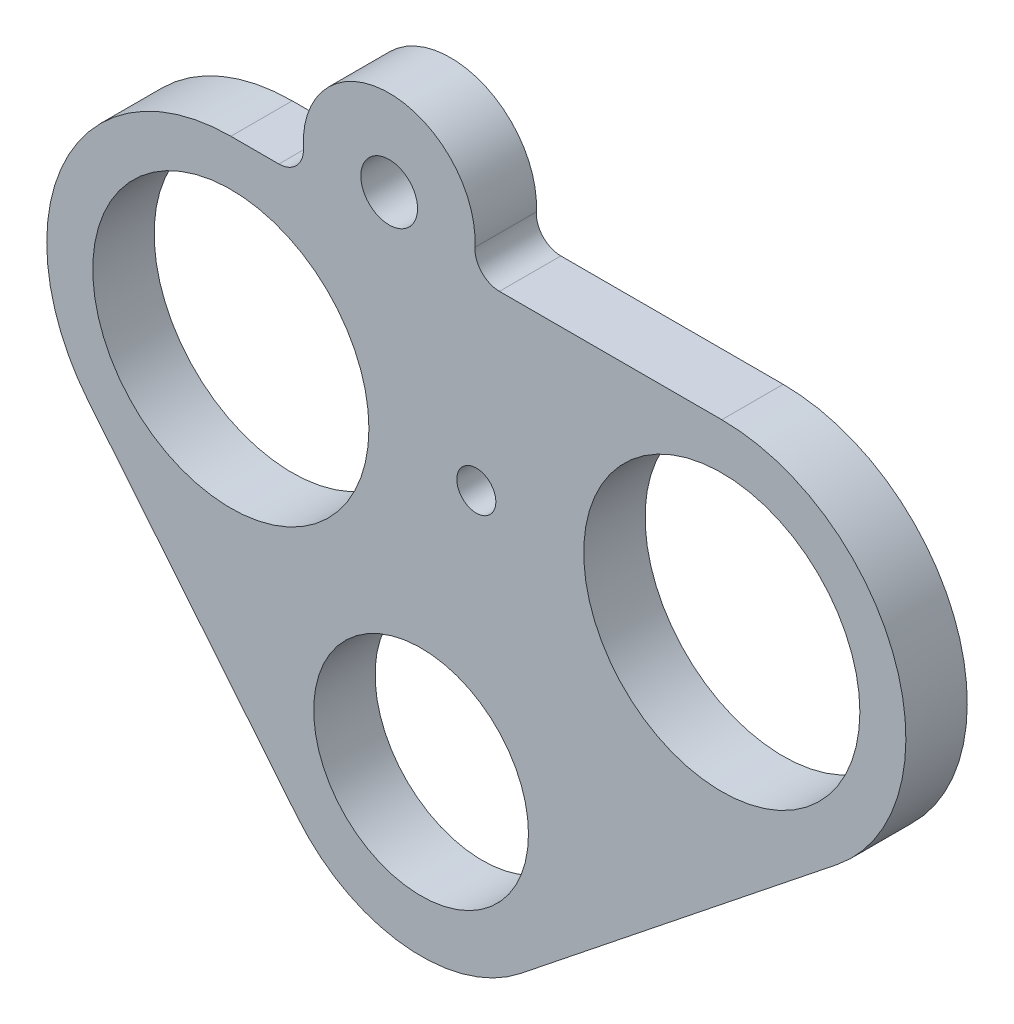
ISO-10303-21;
HEADER;
FILE_DESCRIPTION(('STEP AP214'),'2;1');
FILE_NAME('part.step','',(''),(''),'','','');
FILE_SCHEMA(('AUTOMOTIVE_DESIGN { 1 0 10303 214 1 1 1 1 }'));
ENDSEC;
DATA;
#1=APPLICATION_CONTEXT('core data for automotive mechanical design processes');
#2=APPLICATION_PROTOCOL_DEFINITION('international standard','automotive_design',2000,#1);
#3=PRODUCT_CONTEXT('',#1,'mechanical');
#4=PRODUCT('Part','Part','',(#3));
#5=PRODUCT_RELATED_PRODUCT_CATEGORY('part','',(#4));
#6=PRODUCT_DEFINITION_FORMATION('','',#4);
#7=PRODUCT_DEFINITION_CONTEXT('part definition',#1,'design');
#8=PRODUCT_DEFINITION('design','',#6,#7);
#9=PRODUCT_DEFINITION_SHAPE('','',#8);
#10=(LENGTH_UNIT() NAMED_UNIT(*) SI_UNIT(.MILLI.,.METRE.));
#11=(NAMED_UNIT(*) PLANE_ANGLE_UNIT() SI_UNIT($,.RADIAN.));
#12=(NAMED_UNIT(*) SI_UNIT($,.STERADIAN.) SOLID_ANGLE_UNIT());
#13=UNCERTAINTY_MEASURE_WITH_UNIT(LENGTH_MEASURE(1.E-05),#10,'distance_accuracy_value','');
#14=(GEOMETRIC_REPRESENTATION_CONTEXT(3) GLOBAL_UNCERTAINTY_ASSIGNED_CONTEXT((#13)) GLOBAL_UNIT_ASSIGNED_CONTEXT((#10,
#11,#12)) REPRESENTATION_CONTEXT('',''));
#15=CARTESIAN_POINT('',(0.,0.,0.));
#16=DIRECTION('',(0.,0.,1.));
#17=DIRECTION('',(1.,0.,0.));
#18=AXIS2_PLACEMENT_3D('',#15,#16,#17);
#19=CARTESIAN_POINT('',(-3.30200000000001,50.3017675311814,6.35));
#20=DIRECTION('',(0.,0.,-1.));
#21=DIRECTION('',(-1.,0.,0.));
#22=AXIS2_PLACEMENT_3D('',#19,#20,#21);
#23=CYLINDRICAL_SURFACE('',#22,8.89);
#24=CARTESIAN_POINT('',(-3.30200000000001,50.3017675311814,0.));
#25=DIRECTION('',(0.,0.,1.));
#26=DIRECTION('',(1.,0.,0.));
#27=AXIS2_PLACEMENT_3D('',#24,#25,#26);
#28=CIRCLE('',#27,8.89);
#29=CARTESIAN_POINT('',(5.57427026207697,49.8078786422925,0.));
#30=VERTEX_POINT('',#29);
#31=CARTESIAN_POINT('',(-12.178270262077,49.8078786422925,0.));
#32=VERTEX_POINT('',#31);
#33=EDGE_CURVE('E160',#30,#32,#28,.T.);
#34=ORIENTED_EDGE('',*,*,#33,.T.);
#35=DIRECTION('',(0.,0.,-1.));
#36=VECTOR('',#35,1.);
#37=CARTESIAN_POINT('',(-12.178270262077,49.8078786422925,6.35));
#38=LINE('',#37,#36);
#39=CARTESIAN_POINT('',(-12.178270262077,49.8078786422925,6.35));
#40=VERTEX_POINT('',#39);
#41=EDGE_CURVE('E190',#32,#40,#38,.F.);
#42=ORIENTED_EDGE('',*,*,#41,.T.);
#43=CARTESIAN_POINT('',(-3.30200000000001,50.3017675311814,6.35));
#44=DIRECTION('',(0.,0.,1.));
#45=DIRECTION('',(1.,0.,0.));
#46=AXIS2_PLACEMENT_3D('',#43,#44,#45);
#47=CIRCLE('',#46,8.89);
#48=CARTESIAN_POINT('',(5.57427026207697,49.8078786422925,6.35));
#49=VERTEX_POINT('',#48);
#50=EDGE_CURVE('E136',#49,#40,#47,.T.);
#51=ORIENTED_EDGE('',*,*,#50,.F.);
#52=DIRECTION('',(0.,0.,-1.));
#53=VECTOR('',#52,1.);
#54=CARTESIAN_POINT('',(5.57427026207697,49.8078786422925,6.35));
#55=LINE('',#54,#53);
#56=EDGE_CURVE('E187',#49,#30,#55,.T.);
#57=ORIENTED_EDGE('',*,*,#56,.T.);
#58=EDGE_LOOP('',(#34,#42,#51,#57));
#59=FACE_BOUND('',#58,.T.);
#60=ADVANCED_FACE('F34',(#59),#23,.T.);
#61=CARTESIAN_POINT('',(0.,47.1267675311814,6.35));
#62=DIRECTION('',(0.,1.,0.));
#63=DIRECTION('',(-1.,0.,0.));
#64=AXIS2_PLACEMENT_3D('',#61,#62,#63);
#65=PLANE('',#64);
#66=DIRECTION('',(1.,0.,0.));
#67=VECTOR('',#66,1.);
#68=CARTESIAN_POINT('',(0.,47.1267675311814,6.35));
#69=LINE('',#68,#67);
#70=CARTESIAN_POINT('',(-19.685,47.1267675311814,6.35));
#71=VERTEX_POINT('',#70);
#72=CARTESIAN_POINT('',(-14.7143474798133,47.1267675311814,6.35));
#73=VERTEX_POINT('',#72);
#74=EDGE_CURVE('E114',#71,#73,#69,.T.);
#75=ORIENTED_EDGE('',*,*,#74,.T.);
#76=DIRECTION('',(0.,0.,-1.));
#77=VECTOR('',#76,1.);
#78=CARTESIAN_POINT('',(-14.7143474798133,47.1267675311814,6.35));
#79=LINE('',#78,#77);
#80=CARTESIAN_POINT('',(-14.7143474798133,47.1267675311814,0.));
#81=VERTEX_POINT('',#80);
#82=EDGE_CURVE('E121',#73,#81,#79,.T.);
#83=ORIENTED_EDGE('',*,*,#82,.T.);
#84=DIRECTION('',(1.,0.,0.));
#85=VECTOR('',#84,1.);
#86=CARTESIAN_POINT('',(0.,47.1267675311814,0.));
#87=LINE('',#86,#85);
#88=CARTESIAN_POINT('',(-19.685,47.1267675311814,0.));
#89=VERTEX_POINT('',#88);
#90=EDGE_CURVE('E117',#89,#81,#87,.T.);
#91=ORIENTED_EDGE('',*,*,#90,.F.);
#92=DIRECTION('',(0.,0.,-1.));
#93=VECTOR('',#92,1.);
#94=CARTESIAN_POINT('',(-19.685,47.1267675311814,6.35));
#95=LINE('',#94,#93);
#96=EDGE_CURVE('E109',#71,#89,#95,.T.);
#97=ORIENTED_EDGE('',*,*,#96,.F.);
#98=EDGE_LOOP('',(#75,#83,#91,#97));
#99=FACE_BOUND('',#98,.T.);
#100=ADVANCED_FACE('F111',(#99),#65,.T.);
#101=CARTESIAN_POINT('',(-19.685,28.0767675311814,6.35));
#102=DIRECTION('',(0.,0.,-1.));
#103=DIRECTION('',(-1.,0.,0.));
#104=AXIS2_PLACEMENT_3D('',#101,#102,#103);
#105=CYLINDRICAL_SURFACE('',#104,19.05);
#106=CARTESIAN_POINT('',(-19.685,28.0767675311814,0.));
#107=DIRECTION('',(0.,0.,1.));
#108=DIRECTION('',(1.,0.,0.));
#109=AXIS2_PLACEMENT_3D('',#106,#107,#108);
#110=CIRCLE('',#109,19.05);
#111=CARTESIAN_POINT('',(-34.430269589199,16.0152782059843,0.));
#112=VERTEX_POINT('',#111);
#113=EDGE_CURVE('E165',#89,#112,#110,.T.);
#114=ORIENTED_EDGE('',*,*,#113,.T.);
#115=DIRECTION('',(0.,0.,-1.));
#116=VECTOR('',#115,1.);
#117=CARTESIAN_POINT('',(-34.430269589199,16.0152782059843,6.35));
#118=LINE('',#117,#116);
#119=CARTESIAN_POINT('',(-34.430269589199,16.0152782059843,6.35));
#120=VERTEX_POINT('',#119);
#121=EDGE_CURVE('E122',#120,#112,#118,.T.);
#122=ORIENTED_EDGE('',*,*,#121,.F.);
#123=CARTESIAN_POINT('',(-19.685,28.0767675311814,6.35));
#124=DIRECTION('',(0.,0.,1.));
#125=DIRECTION('',(1.,0.,0.));
#126=AXIS2_PLACEMENT_3D('',#123,#124,#125);
#127=CIRCLE('',#126,19.05);
#128=EDGE_CURVE('E125',#71,#120,#127,.T.);
#129=ORIENTED_EDGE('',*,*,#128,.F.);
#130=ORIENTED_EDGE('',*,*,#96,.T.);
#131=EDGE_LOOP('',(#114,#122,#129,#130));
#132=FACE_BOUND('',#131,.T.);
#133=ADVANCED_FACE('F126',(#132),#105,.T.);
#134=CARTESIAN_POINT('',(-12.7792336439725,-10.4532907485041,6.35));
#135=DIRECTION('',(-0.774029899695487,-0.633149045942102,0.));
#136=DIRECTION('',(0.633149045942102,-0.774029899695487,0.));
#137=AXIS2_PLACEMENT_3D('',#134,#135,#136);
#138=PLANE('',#137);
#139=DIRECTION('',(-0.633149045942102,0.774029899695487,0.));
#140=VECTOR('',#139,1.);
#141=CARTESIAN_POINT('',(-12.7792336439725,-10.4532907485041,0.));
#142=LINE('',#141,#140);
#143=CARTESIAN_POINT('',(-12.7792336439725,-10.4532907485041,0.));
#144=VERTEX_POINT('',#143);
#145=EDGE_CURVE('E168',#144,#112,#142,.T.);
#146=ORIENTED_EDGE('',*,*,#145,.F.);
#147=DIRECTION('',(0.,0.,-1.));
#148=VECTOR('',#147,1.);
#149=CARTESIAN_POINT('',(-12.7792336439725,-10.4532907485041,6.35));
#150=LINE('',#149,#148);
#151=CARTESIAN_POINT('',(-12.7792336439725,-10.4532907485041,6.35));
#152=VERTEX_POINT('',#151);
#153=EDGE_CURVE('E183',#152,#144,#150,.T.);
#154=ORIENTED_EDGE('',*,*,#153,.F.);
#155=DIRECTION('',(-0.633149045942102,0.774029899695487,0.));
#156=VECTOR('',#155,1.);
#157=CARTESIAN_POINT('',(-12.7792336439725,-10.4532907485041,6.35));
#158=LINE('',#157,#156);
#159=EDGE_CURVE('E130',#152,#120,#158,.T.);
#160=ORIENTED_EDGE('',*,*,#159,.T.);
#161=ORIENTED_EDGE('',*,*,#121,.T.);
#162=EDGE_LOOP('',(#146,#154,#160,#161));
#163=FACE_BOUND('',#162,.T.);
#164=ADVANCED_FACE('F258',(#163),#138,.T.);
#165=CARTESIAN_POINT('',(0.,0.,6.35));
#166=DIRECTION('',(0.,0.,-1.));
#167=DIRECTION('',(-1.,0.,0.));
#168=AXIS2_PLACEMENT_3D('',#165,#166,#167);
#169=CYLINDRICAL_SURFACE('',#168,16.51);
#170=CARTESIAN_POINT('',(0.,0.,0.));
#171=DIRECTION('',(0.,0.,1.));
#172=DIRECTION('',(1.,0.,0.));
#173=AXIS2_PLACEMENT_3D('',#170,#171,#172);
#174=CIRCLE('',#173,16.51);
#175=CARTESIAN_POINT('',(10.2973386875126,-12.9052282410912,0.));
#176=VERTEX_POINT('',#175);
#177=EDGE_CURVE('E171',#176,#144,#174,.F.);
#178=ORIENTED_EDGE('',*,*,#177,.F.);
#179=DIRECTION('',(0.,0.,-1.));
#180=VECTOR('',#179,1.);
#181=CARTESIAN_POINT('',(10.2973386875126,-12.9052282410912,6.35));
#182=LINE('',#181,#180);
#183=CARTESIAN_POINT('',(10.2973386875126,-12.9052282410912,6.35));
#184=VERTEX_POINT('',#183);
#185=EDGE_CURVE('E181',#184,#176,#182,.T.);
#186=ORIENTED_EDGE('',*,*,#185,.F.);
#187=CARTESIAN_POINT('',(0.,0.,6.35));
#188=DIRECTION('',(0.,0.,1.));
#189=DIRECTION('',(1.,0.,0.));
#190=AXIS2_PLACEMENT_3D('',#187,#188,#189);
#191=CIRCLE('',#190,16.51);
#192=EDGE_CURVE('E153',#184,#152,#191,.F.);
#193=ORIENTED_EDGE('',*,*,#192,.T.);
#194=ORIENTED_EDGE('',*,*,#153,.T.);
#195=EDGE_LOOP('',(#178,#186,#193,#194));
#196=FACE_BOUND('',#195,.T.);
#197=ADVANCED_FACE('F255',(#196),#169,.T.);
#198=CARTESIAN_POINT('',(10.2973386875126,-12.9052282410912,6.35));
#199=DIRECTION('',(0.623703130679138,-0.781661310786867,0.));
#200=DIRECTION('',(0.781661310786867,0.623703130679138,0.));
#201=AXIS2_PLACEMENT_3D('',#198,#199,#200);
#202=PLANE('',#201);
#203=DIRECTION('',(-0.781661310786867,-0.623703130679138,0.));
#204=VECTOR('',#203,1.);
#205=CARTESIAN_POINT('',(10.2973386875126,-12.9052282410912,0.));
#206=LINE('',#205,#204);
#207=CARTESIAN_POINT('',(42.9965446394376,13.1861195606916,0.));
#208=VERTEX_POINT('',#207);
#209=EDGE_CURVE('E174',#208,#176,#206,.T.);
#210=ORIENTED_EDGE('',*,*,#209,.F.);
#211=DIRECTION('',(0.,0.,-1.));
#212=VECTOR('',#211,1.);
#213=CARTESIAN_POINT('',(42.9965446394376,13.1861195606916,6.35));
#214=LINE('',#213,#212);
#215=CARTESIAN_POINT('',(42.9965446394376,13.1861195606916,6.35));
#216=VERTEX_POINT('',#215);
#217=EDGE_CURVE('E145',#216,#208,#214,.T.);
#218=ORIENTED_EDGE('',*,*,#217,.F.);
#219=DIRECTION('',(-0.781661310786867,-0.623703130679138,0.));
#220=VECTOR('',#219,1.);
#221=CARTESIAN_POINT('',(10.2973386875126,-12.9052282410912,6.35));
#222=LINE('',#221,#220);
#223=EDGE_CURVE('E148',#216,#184,#222,.T.);
#224=ORIENTED_EDGE('',*,*,#223,.T.);
#225=ORIENTED_EDGE('',*,*,#185,.T.);
#226=EDGE_LOOP('',(#210,#218,#224,#225));
#227=FACE_BOUND('',#226,.T.);
#228=ADVANCED_FACE('F230',(#227),#202,.T.);
#229=CARTESIAN_POINT('',(31.115,28.0767675311814,6.35));
#230=DIRECTION('',(0.,0.,-1.));
#231=DIRECTION('',(-1.,0.,0.));
#232=AXIS2_PLACEMENT_3D('',#229,#230,#231);
#233=CYLINDRICAL_SURFACE('',#232,19.05);
#234=CARTESIAN_POINT('',(31.115,28.0767675311814,0.));
#235=DIRECTION('',(0.,0.,1.));
#236=DIRECTION('',(1.,0.,0.));
#237=AXIS2_PLACEMENT_3D('',#234,#235,#236);
#238=CIRCLE('',#237,19.05);
#239=CARTESIAN_POINT('',(31.115,47.1267675311814,0.));
#240=VERTEX_POINT('',#239);
#241=EDGE_CURVE('E177',#240,#208,#238,.F.);
#242=ORIENTED_EDGE('',*,*,#241,.F.);
#243=DIRECTION('',(0.,0.,-1.));
#244=VECTOR('',#243,1.);
#245=CARTESIAN_POINT('',(31.115,47.1267675311814,6.35));
#246=LINE('',#245,#244);
#247=CARTESIAN_POINT('',(31.115,47.1267675311814,6.35));
#248=VERTEX_POINT('',#247);
#249=EDGE_CURVE('E141',#248,#240,#246,.T.);
#250=ORIENTED_EDGE('',*,*,#249,.F.);
#251=CARTESIAN_POINT('',(31.115,28.0767675311814,6.35));
#252=DIRECTION('',(0.,0.,1.));
#253=DIRECTION('',(1.,0.,0.));
#254=AXIS2_PLACEMENT_3D('',#251,#252,#253);
#255=CIRCLE('',#254,19.05);
#256=EDGE_CURVE('E142',#248,#216,#255,.F.);
#257=ORIENTED_EDGE('',*,*,#256,.T.);
#258=ORIENTED_EDGE('',*,*,#217,.T.);
#259=EDGE_LOOP('',(#242,#250,#257,#258));
#260=FACE_BOUND('',#259,.T.);
#261=ADVANCED_FACE('F224',(#260),#233,.T.);
#262=CARTESIAN_POINT('',(-3.30200000000001,50.3017675311814,6.35));
#263=DIRECTION('',(0.,0.,-1.));
#264=DIRECTION('',(-1.,0.,0.));
#265=AXIS2_PLACEMENT_3D('',#262,#263,#264);
#266=CYLINDRICAL_SURFACE('',#265,2.9337);
#267=CARTESIAN_POINT('',(-3.30200000000001,50.3017675311814,6.35));
#268=DIRECTION('',(0.,0.,1.));
#269=DIRECTION('',(1.,0.,0.));
#270=AXIS2_PLACEMENT_3D('',#267,#268,#269);
#271=CIRCLE('',#270,2.9337);
#272=CARTESIAN_POINT('',(-0.368300000000002,50.3017675311814,6.35));
#273=VERTEX_POINT('',#272);
#274=EDGE_CURVE('E139',#273,#273,#271,.T.);
#275=ORIENTED_EDGE('',*,*,#274,.T.);
#276=EDGE_LOOP('',(#275));
#277=FACE_BOUND('',#276,.T.);
#278=CARTESIAN_POINT('',(-3.30200000000001,50.3017675311814,0.));
#279=DIRECTION('',(0.,0.,1.));
#280=DIRECTION('',(1.,0.,0.));
#281=AXIS2_PLACEMENT_3D('',#278,#279,#280);
#282=CIRCLE('',#281,2.9337);
#283=CARTESIAN_POINT('',(-0.368300000000002,50.3017675311814,0.));
#284=VERTEX_POINT('',#283);
#285=EDGE_CURVE('E157',#284,#284,#282,.T.);
#286=ORIENTED_EDGE('',*,*,#285,.F.);
#287=EDGE_LOOP('',(#286));
#288=FACE_BOUND('',#287,.T.);
#289=ADVANCED_FACE('F222',(#277,#288),#266,.F.);
#290=CARTESIAN_POINT('',(8.11034747981325,47.1267675311814,0.));
#291=VERTEX_POINT('',#290);
#292=EDGE_CURVE('E166',#291,#240,#87,.T.);
#293=ORIENTED_EDGE('',*,*,#292,.F.);
#294=DIRECTION('',(0.,0.,-1.));
#295=VECTOR('',#294,1.);
#296=CARTESIAN_POINT('',(8.11034747981325,47.1267675311814,6.35));
#297=LINE('',#296,#295);
#298=CARTESIAN_POINT('',(8.11034747981325,47.1267675311814,6.35));
#299=VERTEX_POINT('',#298);
#300=EDGE_CURVE('E49',#291,#299,#297,.F.);
#301=ORIENTED_EDGE('',*,*,#300,.T.);
#302=EDGE_CURVE('E138',#299,#248,#69,.T.);
#303=ORIENTED_EDGE('',*,*,#302,.T.);
#304=ORIENTED_EDGE('',*,*,#249,.T.);
#305=EDGE_LOOP('',(#293,#301,#303,#304));
#306=FACE_BOUND('',#305,.T.);
#307=ADVANCED_FACE('F219',(#306),#65,.T.);
#308=CARTESIAN_POINT('',(0.,0.,6.35));
#309=DIRECTION('',(0.,0.,1.));
#310=DIRECTION('',(1.,0.,0.));
#311=AXIS2_PLACEMENT_3D('',#308,#309,#310);
#312=PLANE('',#311);
#313=CARTESIAN_POINT('',(5.71499999999999,28.0767675311814,6.35));
#314=DIRECTION('',(0.,0.,1.));
#315=DIRECTION('',(1.,0.,0.));
#316=AXIS2_PLACEMENT_3D('',#313,#314,#315);
#317=CIRCLE('',#316,2.0193);
#318=CARTESIAN_POINT('',(7.73429999999999,28.0767675311814,6.35));
#319=VERTEX_POINT('',#318);
#320=EDGE_CURVE('E294',#319,#319,#317,.T.);
#321=ORIENTED_EDGE('',*,*,#320,.F.);
#322=EDGE_LOOP('',(#321));
#323=FACE_BOUND('',#322,.T.);
#324=CARTESIAN_POINT('',(0.,0.,6.35));
#325=DIRECTION('',(0.,0.,1.));
#326=DIRECTION('',(1.,0.,0.));
#327=AXIS2_PLACEMENT_3D('',#324,#325,#326);
#328=CIRCLE('',#327,11.1125);
#329=CARTESIAN_POINT('',(11.1125,0.,6.35));
#330=VERTEX_POINT('',#329);
#331=EDGE_CURVE('E289',#330,#330,#328,.T.);
#332=ORIENTED_EDGE('',*,*,#331,.F.);
#333=EDGE_LOOP('',(#332));
#334=FACE_BOUND('',#333,.T.);
#335=CARTESIAN_POINT('',(-19.685,28.0767675311814,6.35));
#336=DIRECTION('',(0.,0.,1.));
#337=DIRECTION('',(1.,0.,0.));
#338=AXIS2_PLACEMENT_3D('',#335,#336,#337);
#339=CIRCLE('',#338,14.2875);
#340=CARTESIAN_POINT('',(-5.39750000000002,28.0767675311814,6.35));
#341=VERTEX_POINT('',#340);
#342=EDGE_CURVE('E283',#341,#341,#339,.T.);
#343=ORIENTED_EDGE('',*,*,#342,.F.);
#344=EDGE_LOOP('',(#343));
#345=FACE_BOUND('',#344,.T.);
#346=CARTESIAN_POINT('',(31.115,28.0767675311814,6.35));
#347=DIRECTION('',(0.,0.,1.));
#348=DIRECTION('',(1.,0.,0.));
#349=AXIS2_PLACEMENT_3D('',#346,#347,#348);
#350=CIRCLE('',#349,14.2875);
#351=CARTESIAN_POINT('',(45.4025,28.0767675311814,6.35));
#352=VERTEX_POINT('',#351);
#353=EDGE_CURVE('E277',#352,#352,#350,.T.);
#354=ORIENTED_EDGE('',*,*,#353,.F.);
#355=EDGE_LOOP('',(#354));
#356=FACE_BOUND('',#355,.T.);
#357=ORIENTED_EDGE('',*,*,#274,.F.);
#358=EDGE_LOOP('',(#357));
#359=FACE_BOUND('',#358,.T.);
#360=ORIENTED_EDGE('',*,*,#302,.F.);
#361=CARTESIAN_POINT('',(8.11034747981325,49.6667675311814,6.35));
#362=DIRECTION('',(0.,0.,1.));
#363=DIRECTION('',(1.,0.,0.));
#364=AXIS2_PLACEMENT_3D('',#361,#362,#363);
#365=CIRCLE('',#364,2.54);
#366=EDGE_CURVE('E11',#299,#49,#365,.F.);
#367=ORIENTED_EDGE('',*,*,#366,.T.);
#368=ORIENTED_EDGE('',*,*,#50,.T.);
#369=CARTESIAN_POINT('',(-14.7143474798133,49.6667675311814,6.35));
#370=DIRECTION('',(0.,0.,1.));
#371=DIRECTION('',(1.,0.,0.));
#372=AXIS2_PLACEMENT_3D('',#369,#370,#371);
#373=CIRCLE('',#372,2.54);
#374=EDGE_CURVE('E135',#40,#73,#373,.F.);
#375=ORIENTED_EDGE('',*,*,#374,.T.);
#376=ORIENTED_EDGE('',*,*,#74,.F.);
#377=ORIENTED_EDGE('',*,*,#128,.T.);
#378=ORIENTED_EDGE('',*,*,#159,.F.);
#379=ORIENTED_EDGE('',*,*,#192,.F.);
#380=ORIENTED_EDGE('',*,*,#223,.F.);
#381=ORIENTED_EDGE('',*,*,#256,.F.);
#382=EDGE_LOOP('',(#360,#367,#368,#375,#376,#377,#378,#379,#380,#381));
#383=FACE_BOUND('',#382,.T.);
#384=ADVANCED_FACE('F132',(#323,#334,#345,#356,#359,#383),#312,.T.);
#385=CARTESIAN_POINT('',(0.,0.,0.));
#386=DIRECTION('',(0.,0.,1.));
#387=DIRECTION('',(1.,0.,0.));
#388=AXIS2_PLACEMENT_3D('',#385,#386,#387);
#389=PLANE('',#388);
#390=CARTESIAN_POINT('',(5.71499999999999,28.0767675311814,0.));
#391=DIRECTION('',(0.,0.,1.));
#392=DIRECTION('',(1.,0.,0.));
#393=AXIS2_PLACEMENT_3D('',#390,#391,#392);
#394=CIRCLE('',#393,2.0193);
#395=CARTESIAN_POINT('',(7.73429999999999,28.0767675311814,0.));
#396=VERTEX_POINT('',#395);
#397=EDGE_CURVE('E292',#396,#396,#394,.T.);
#398=ORIENTED_EDGE('',*,*,#397,.T.);
#399=EDGE_LOOP('',(#398));
#400=FACE_BOUND('',#399,.T.);
#401=CARTESIAN_POINT('',(0.,0.,0.));
#402=DIRECTION('',(0.,0.,1.));
#403=DIRECTION('',(1.,0.,0.));
#404=AXIS2_PLACEMENT_3D('',#401,#402,#403);
#405=CIRCLE('',#404,11.1125);
#406=CARTESIAN_POINT('',(11.1125,0.,0.));
#407=VERTEX_POINT('',#406);
#408=EDGE_CURVE('E286',#407,#407,#405,.T.);
#409=ORIENTED_EDGE('',*,*,#408,.T.);
#410=EDGE_LOOP('',(#409));
#411=FACE_BOUND('',#410,.T.);
#412=CARTESIAN_POINT('',(-19.685,28.0767675311814,0.));
#413=DIRECTION('',(0.,0.,1.));
#414=DIRECTION('',(1.,0.,0.));
#415=AXIS2_PLACEMENT_3D('',#412,#413,#414);
#416=CIRCLE('',#415,14.2875);
#417=CARTESIAN_POINT('',(-5.39750000000002,28.0767675311814,0.));
#418=VERTEX_POINT('',#417);
#419=EDGE_CURVE('E280',#418,#418,#416,.T.);
#420=ORIENTED_EDGE('',*,*,#419,.T.);
#421=EDGE_LOOP('',(#420));
#422=FACE_BOUND('',#421,.T.);
#423=CARTESIAN_POINT('',(31.115,28.0767675311814,0.));
#424=DIRECTION('',(0.,0.,1.));
#425=DIRECTION('',(1.,0.,0.));
#426=AXIS2_PLACEMENT_3D('',#423,#424,#425);
#427=CIRCLE('',#426,14.2875);
#428=CARTESIAN_POINT('',(45.4025,28.0767675311814,0.));
#429=VERTEX_POINT('',#428);
#430=EDGE_CURVE('E161',#429,#429,#427,.T.);
#431=ORIENTED_EDGE('',*,*,#430,.T.);
#432=EDGE_LOOP('',(#431));
#433=FACE_BOUND('',#432,.T.);
#434=ORIENTED_EDGE('',*,*,#285,.T.);
#435=EDGE_LOOP('',(#434));
#436=FACE_BOUND('',#435,.T.);
#437=ORIENTED_EDGE('',*,*,#33,.F.);
#438=CARTESIAN_POINT('',(8.11034747981325,49.6667675311814,0.));
#439=DIRECTION('',(0.,0.,1.));
#440=DIRECTION('',(1.,0.,0.));
#441=AXIS2_PLACEMENT_3D('',#438,#439,#440);
#442=CIRCLE('',#441,2.54);
#443=EDGE_CURVE('E42',#30,#291,#442,.T.);
#444=ORIENTED_EDGE('',*,*,#443,.T.);
#445=ORIENTED_EDGE('',*,*,#292,.T.);
#446=ORIENTED_EDGE('',*,*,#241,.T.);
#447=ORIENTED_EDGE('',*,*,#209,.T.);
#448=ORIENTED_EDGE('',*,*,#177,.T.);
#449=ORIENTED_EDGE('',*,*,#145,.T.);
#450=ORIENTED_EDGE('',*,*,#113,.F.);
#451=ORIENTED_EDGE('',*,*,#90,.T.);
#452=CARTESIAN_POINT('',(-14.7143474798133,49.6667675311814,0.));
#453=DIRECTION('',(0.,0.,1.));
#454=DIRECTION('',(1.,0.,0.));
#455=AXIS2_PLACEMENT_3D('',#452,#453,#454);
#456=CIRCLE('',#455,2.54);
#457=EDGE_CURVE('E193',#81,#32,#456,.T.);
#458=ORIENTED_EDGE('',*,*,#457,.T.);
#459=EDGE_LOOP('',(#437,#444,#445,#446,#447,#448,#449,#450,#451,#458));
#460=FACE_BOUND('',#459,.T.);
#461=ADVANCED_FACE('F195',(#400,#411,#422,#433,#436,#460),#389,.F.);
#462=CARTESIAN_POINT('',(31.115,28.0767675311814,6.35));
#463=DIRECTION('',(0.,0.,1.));
#464=DIRECTION('',(1.,0.,0.));
#465=AXIS2_PLACEMENT_3D('',#462,#463,#464);
#466=CYLINDRICAL_SURFACE('',#465,14.2875);
#467=ORIENTED_EDGE('',*,*,#353,.T.);
#468=EDGE_LOOP('',(#467));
#469=FACE_BOUND('',#468,.T.);
#470=ORIENTED_EDGE('',*,*,#430,.F.);
#471=EDGE_LOOP('',(#470));
#472=FACE_BOUND('',#471,.T.);
#473=ADVANCED_FACE('F238',(#469,#472),#466,.F.);
#474=CARTESIAN_POINT('',(-19.685,28.0767675311814,6.35));
#475=DIRECTION('',(0.,0.,1.));
#476=DIRECTION('',(1.,0.,0.));
#477=AXIS2_PLACEMENT_3D('',#474,#475,#476);
#478=CYLINDRICAL_SURFACE('',#477,14.2875);
#479=ORIENTED_EDGE('',*,*,#342,.T.);
#480=EDGE_LOOP('',(#479));
#481=FACE_BOUND('',#480,.T.);
#482=ORIENTED_EDGE('',*,*,#419,.F.);
#483=EDGE_LOOP('',(#482));
#484=FACE_BOUND('',#483,.T.);
#485=ADVANCED_FACE('F245',(#481,#484),#478,.F.);
#486=CARTESIAN_POINT('',(0.,0.,6.35));
#487=DIRECTION('',(0.,0.,1.));
#488=DIRECTION('',(1.,0.,0.));
#489=AXIS2_PLACEMENT_3D('',#486,#487,#488);
#490=CYLINDRICAL_SURFACE('',#489,11.1125);
#491=ORIENTED_EDGE('',*,*,#331,.T.);
#492=EDGE_LOOP('',(#491));
#493=FACE_BOUND('',#492,.T.);
#494=ORIENTED_EDGE('',*,*,#408,.F.);
#495=EDGE_LOOP('',(#494));
#496=FACE_BOUND('',#495,.T.);
#497=ADVANCED_FACE('F209',(#493,#496),#490,.F.);
#498=CARTESIAN_POINT('',(5.71499999999999,28.0767675311814,6.35));
#499=DIRECTION('',(0.,0.,1.));
#500=DIRECTION('',(1.,0.,0.));
#501=AXIS2_PLACEMENT_3D('',#498,#499,#500);
#502=CYLINDRICAL_SURFACE('',#501,2.0193);
#503=ORIENTED_EDGE('',*,*,#397,.F.);
#504=EDGE_LOOP('',(#503));
#505=FACE_BOUND('',#504,.T.);
#506=ORIENTED_EDGE('',*,*,#320,.T.);
#507=EDGE_LOOP('',(#506));
#508=FACE_BOUND('',#507,.T.);
#509=ADVANCED_FACE('F203',(#505,#508),#502,.F.);
#510=CARTESIAN_POINT('',(-14.7143474798133,49.6667675311814,6.35));
#511=DIRECTION('',(0.,0.,-1.));
#512=DIRECTION('',(-1.,0.,0.));
#513=AXIS2_PLACEMENT_3D('',#510,#511,#512);
#514=CYLINDRICAL_SURFACE('',#513,2.54);
#515=ORIENTED_EDGE('',*,*,#374,.F.);
#516=ORIENTED_EDGE('',*,*,#41,.F.);
#517=ORIENTED_EDGE('',*,*,#457,.F.);
#518=ORIENTED_EDGE('',*,*,#82,.F.);
#519=EDGE_LOOP('',(#515,#516,#517,#518));
#520=FACE_BOUND('',#519,.T.);
#521=ADVANCED_FACE('F201',(#520),#514,.F.);
#522=CARTESIAN_POINT('',(8.11034747981325,49.6667675311814,6.35));
#523=DIRECTION('',(0.,0.,-1.));
#524=DIRECTION('',(-1.,0.,0.));
#525=AXIS2_PLACEMENT_3D('',#522,#523,#524);
#526=CYLINDRICAL_SURFACE('',#525,2.54);
#527=ORIENTED_EDGE('',*,*,#366,.F.);
#528=ORIENTED_EDGE('',*,*,#300,.F.);
#529=ORIENTED_EDGE('',*,*,#443,.F.);
#530=ORIENTED_EDGE('',*,*,#56,.F.);
#531=EDGE_LOOP('',(#527,#528,#529,#530));
#532=FACE_BOUND('',#531,.T.);
#533=ADVANCED_FACE('F36',(#532),#526,.F.);
#534=CLOSED_SHELL('',(#60,#100,#133,#164,#197,#228,#261,#289,#307,#384,#461,#473,#485,#497,#509,
#521,#533));
#535=MANIFOLD_SOLID_BREP('B2',#534);
#536=ADVANCED_BREP_SHAPE_REPRESENTATION('',(#18,#535),#14);
#537=SHAPE_DEFINITION_REPRESENTATION(#9,#536);
ENDSEC;
END-ISO-10303-21;
